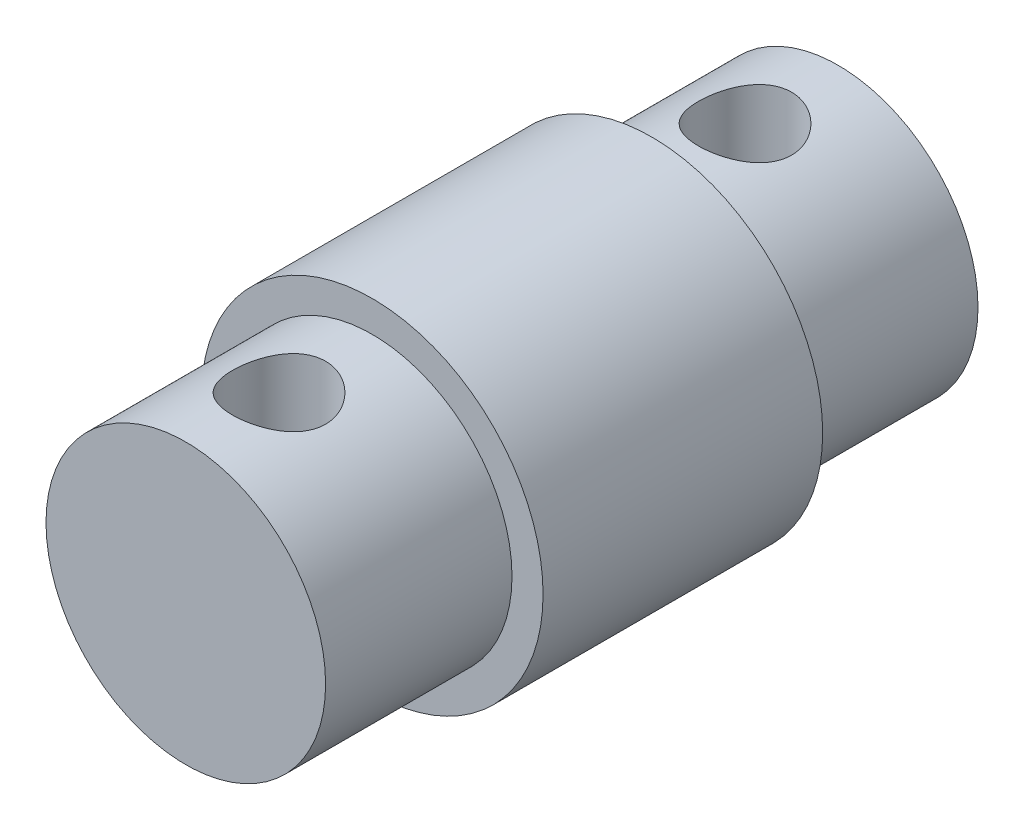
ISO-10303-21;
HEADER;
FILE_DESCRIPTION(('STEP AP214'),'2;1');
FILE_NAME('part.step','',(''),(''),'','','');
FILE_SCHEMA(('AUTOMOTIVE_DESIGN { 1 0 10303 214 1 1 1 1 }'));
ENDSEC;
DATA;
#1=APPLICATION_CONTEXT('core data for automotive mechanical design processes');
#2=APPLICATION_PROTOCOL_DEFINITION('international standard','automotive_design',2000,#1);
#3=PRODUCT_CONTEXT('',#1,'mechanical');
#4=PRODUCT('Part','Part','',(#3));
#5=PRODUCT_RELATED_PRODUCT_CATEGORY('part','',(#4));
#6=PRODUCT_DEFINITION_FORMATION('','',#4);
#7=PRODUCT_DEFINITION_CONTEXT('part definition',#1,'design');
#8=PRODUCT_DEFINITION('design','',#6,#7);
#9=PRODUCT_DEFINITION_SHAPE('','',#8);
#10=(LENGTH_UNIT() NAMED_UNIT(*) SI_UNIT(.MILLI.,.METRE.));
#11=(NAMED_UNIT(*) PLANE_ANGLE_UNIT() SI_UNIT($,.RADIAN.));
#12=(NAMED_UNIT(*) SI_UNIT($,.STERADIAN.) SOLID_ANGLE_UNIT());
#13=UNCERTAINTY_MEASURE_WITH_UNIT(LENGTH_MEASURE(1.E-05),#10,'distance_accuracy_value','');
#14=(GEOMETRIC_REPRESENTATION_CONTEXT(3) GLOBAL_UNCERTAINTY_ASSIGNED_CONTEXT((#13)) GLOBAL_UNIT_ASSIGNED_CONTEXT((#10,
#11,#12)) REPRESENTATION_CONTEXT('',''));
#15=CARTESIAN_POINT('',(0.,0.,0.));
#16=DIRECTION('',(0.,0.,1.));
#17=DIRECTION('',(1.,0.,0.));
#18=AXIS2_PLACEMENT_3D('',#15,#16,#17);
#19=CARTESIAN_POINT('',(0.,0.,9.));
#20=DIRECTION('',(0.,0.,-1.));
#21=DIRECTION('',(-1.,0.,0.));
#22=AXIS2_PLACEMENT_3D('',#19,#20,#21);
#23=CYLINDRICAL_SURFACE('',#22,5.5);
#24=CARTESIAN_POINT('',(0.,0.,9.));
#25=DIRECTION('',(0.,0.,1.));
#26=DIRECTION('',(1.,0.,0.));
#27=AXIS2_PLACEMENT_3D('',#24,#25,#26);
#28=CIRCLE('',#27,5.5);
#29=CARTESIAN_POINT('',(5.5,0.,9.));
#30=VERTEX_POINT('',#29);
#31=EDGE_CURVE('E62',#30,#30,#28,.T.);
#32=ORIENTED_EDGE('',*,*,#31,.F.);
#33=EDGE_LOOP('',(#32));
#34=FACE_BOUND('',#33,.T.);
#35=CARTESIAN_POINT('',(0.,0.,0.));
#36=DIRECTION('',(0.,0.,1.));
#37=DIRECTION('',(1.,0.,0.));
#38=AXIS2_PLACEMENT_3D('',#35,#36,#37);
#39=CIRCLE('',#38,5.5);
#40=CARTESIAN_POINT('',(5.5,0.,0.));
#41=VERTEX_POINT('',#40);
#42=EDGE_CURVE('E70',#41,#41,#39,.T.);
#43=ORIENTED_EDGE('',*,*,#42,.T.);
#44=EDGE_LOOP('',(#43));
#45=FACE_BOUND('',#44,.T.);
#46=ADVANCED_FACE('F43',(#34,#45),#23,.T.);
#47=CARTESIAN_POINT('',(0.,0.,9.));
#48=DIRECTION('',(0.,0.,1.));
#49=DIRECTION('',(1.,0.,0.));
#50=AXIS2_PLACEMENT_3D('',#47,#48,#49);
#51=PLANE('',#50);
#52=CARTESIAN_POINT('',(0.,0.,9.));
#53=DIRECTION('',(0.,0.,1.));
#54=DIRECTION('',(1.,0.,0.));
#55=AXIS2_PLACEMENT_3D('',#52,#53,#54);
#56=CIRCLE('',#55,4.5);
#57=CARTESIAN_POINT('',(4.5,0.,9.));
#58=VERTEX_POINT('',#57);
#59=EDGE_CURVE('E56',#58,#58,#56,.T.);
#60=ORIENTED_EDGE('',*,*,#59,.F.);
#61=EDGE_LOOP('',(#60));
#62=FACE_BOUND('',#61,.T.);
#63=ORIENTED_EDGE('',*,*,#31,.T.);
#64=EDGE_LOOP('',(#63));
#65=FACE_BOUND('',#64,.T.);
#66=ADVANCED_FACE('F119',(#62,#65),#51,.T.);
#67=CARTESIAN_POINT('',(0.,0.,0.));
#68=DIRECTION('',(0.,0.,1.));
#69=DIRECTION('',(1.,0.,0.));
#70=AXIS2_PLACEMENT_3D('',#67,#68,#69);
#71=PLANE('',#70);
#72=CARTESIAN_POINT('',(0.,0.,0.));
#73=DIRECTION('',(0.,0.,-1.));
#74=DIRECTION('',(-1.,0.,0.));
#75=AXIS2_PLACEMENT_3D('',#72,#73,#74);
#76=CIRCLE('',#75,4.5);
#77=CARTESIAN_POINT('',(-4.5,0.,0.));
#78=VERTEX_POINT('',#77);
#79=EDGE_CURVE('E10',#78,#78,#76,.T.);
#80=ORIENTED_EDGE('',*,*,#79,.F.);
#81=EDGE_LOOP('',(#80));
#82=FACE_BOUND('',#81,.T.);
#83=ORIENTED_EDGE('',*,*,#42,.F.);
#84=EDGE_LOOP('',(#83));
#85=FACE_BOUND('',#84,.T.);
#86=ADVANCED_FACE('F117',(#82,#85),#71,.F.);
#87=CARTESIAN_POINT('',(0.,0.,15.));
#88=DIRECTION('',(0.,0.,-1.));
#89=DIRECTION('',(-1.,0.,0.));
#90=AXIS2_PLACEMENT_3D('',#87,#88,#89);
#91=CYLINDRICAL_SURFACE('',#90,4.5);
#92=CARTESIAN_POINT('',(0.,-4.5,13.5));
#93=CARTESIAN_POINT('',(0.0818450443300849,-4.50000022951416,13.5000003805975));
#94=CARTESIAN_POINT('',(0.163687791807825,-4.49774654261317,13.4932796008092));
#95=CARTESIAN_POINT('',(0.324962641309459,-4.48897815304921,13.4666563367742));
#96=CARTESIAN_POINT('',(0.404394492178227,-4.48246300803229,13.4467524840766));
#97=CARTESIAN_POINT('',(0.558499184252665,-4.46587961859664,13.3945211349239));
#98=CARTESIAN_POINT('',(0.633179738829052,-4.4558173159628,13.3622144063111));
#99=CARTESIAN_POINT('',(0.776062405207988,-4.43316668576013,13.2861882407425));
#100=CARTESIAN_POINT('',(0.844263235438059,-4.42057786001667,13.2424665524961));
#101=CARTESIAN_POINT('',(0.9746125125334,-4.39371141664507,13.1432612927119));
#102=CARTESIAN_POINT('',(1.03650555044746,-4.37939334695677,13.0874531486093));
#103=CARTESIAN_POINT('',(1.15024903905313,-4.35090472174682,12.9663492679401));
#104=CARTESIAN_POINT('',(1.20209727823419,-4.33673419935823,12.9010514476072));
#105=CARTESIAN_POINT('',(1.29573741334179,-4.30969998715911,12.7605223272053));
#106=CARTESIAN_POINT('',(1.33719728733155,-4.29688558913532,12.6850593904018));
#107=CARTESIAN_POINT('',(1.40672831081658,-4.27462958127902,12.5277358583122));
#108=CARTESIAN_POINT('',(1.43480354608015,-4.26518694241118,12.4458772242559));
#109=CARTESIAN_POINT('',(1.47581019226375,-4.25116954904066,12.2809901677549));
#110=CARTESIAN_POINT('',(1.48922017240765,-4.24644143654417,12.1980941872664));
#111=CARTESIAN_POINT('',(1.50201168500172,-4.24193484944261,12.0311043687662));
#112=CARTESIAN_POINT('',(1.50139755240708,-4.24215484534095,11.9470109089362));
#113=CARTESIAN_POINT('',(1.48652985555513,-4.2473852251227,11.784095054334));
#114=CARTESIAN_POINT('',(1.47290086975049,-4.25217623801299,11.7052073956215));
#115=CARTESIAN_POINT('',(1.43340924427413,-4.26564986586826,11.5509098705897));
#116=CARTESIAN_POINT('',(1.40754513988781,-4.27433294676161,11.4755004218474));
#117=CARTESIAN_POINT('',(1.34390858709032,-4.29476866696873,11.3288808756128));
#118=CARTESIAN_POINT('',(1.30595107306089,-4.30656848689676,11.2577579617957));
#119=CARTESIAN_POINT('',(1.21933365945471,-4.3318883786359,11.1226936375804));
#120=CARTESIAN_POINT('',(1.17067066854601,-4.34540894685695,11.0587543095999));
#121=CARTESIAN_POINT('',(1.06102399902336,-4.37350993751611,10.9363626027588));
#122=CARTESIAN_POINT('',(0.999529725114467,-4.38810884032264,10.8783709582364));
#123=CARTESIAN_POINT('',(0.867509354955096,-4.41610407580555,10.7734031000049));
#124=CARTESIAN_POINT('',(0.796982393491222,-4.42950029307101,10.7264279427533));
#125=CARTESIAN_POINT('',(0.647921419569403,-4.4537566190669,10.6444555496474));
#126=CARTESIAN_POINT('',(0.569314914624506,-4.46459025012059,10.6095817629889));
#127=CARTESIAN_POINT('',(0.406903625046762,-4.48230850716652,10.5536952390664));
#128=CARTESIAN_POINT('',(0.323100657232431,-4.48919450482319,10.5326776868648));
#129=CARTESIAN_POINT('',(0.156575744293956,-4.49801440607161,10.5059165009665));
#130=CARTESIAN_POINT('',(0.0739643997972695,-4.50015002750592,10.4995502862409));
#131=CARTESIAN_POINT('',(-0.0911626049403559,-4.49983354042241,10.5004990103977));
#132=CARTESIAN_POINT('',(-0.173678278979476,-4.49738220629043,10.5078116399698));
#133=CARTESIAN_POINT('',(-0.333779799456384,-4.48830037075656,10.5354178616039));
#134=CARTESIAN_POINT('',(-0.411439210252266,-4.48179298066788,10.5553293090742));
#135=CARTESIAN_POINT('',(-0.562283937869361,-4.46537770245105,10.6070901667001));
#136=CARTESIAN_POINT('',(-0.63546868276291,-4.45546938070013,10.6389410992017));
#137=CARTESIAN_POINT('',(-0.77743244458991,-4.43293396930935,10.7146056477612));
#138=CARTESIAN_POINT('',(-0.84604493882572,-4.42024222133679,10.7587118899248));
#139=CARTESIAN_POINT('',(-0.975097245203379,-4.39357880874394,10.8572912250202));
#140=CARTESIAN_POINT('',(-1.03553455169336,-4.37960675390741,10.9117674840476));
#141=CARTESIAN_POINT('',(-1.14937876170945,-4.35115271970667,11.0324681265099));
#142=CARTESIAN_POINT('',(-1.20234145386866,-4.33667641631142,11.0991138403903));
#143=CARTESIAN_POINT('',(-1.29638628348536,-4.30949959942063,11.2406573517163));
#144=CARTESIAN_POINT('',(-1.33746832189652,-4.29679910073003,11.3155552179511));
#145=CARTESIAN_POINT('',(-1.40639539562454,-4.27473587687075,11.4715095229348));
#146=CARTESIAN_POINT('',(-1.43426719824753,-4.26536641189468,11.5525531187531));
#147=CARTESIAN_POINT('',(-1.47584200013903,-4.25116248459674,11.7185679750662));
#148=CARTESIAN_POINT('',(-1.48955138243091,-4.24632597935459,11.8035374481065));
#149=CARTESIAN_POINT('',(-1.50191442371601,-4.24196788311266,11.9702956440614));
#150=CARTESIAN_POINT('',(-1.5013053859626,-4.24218600386123,12.0520235104302));
#151=CARTESIAN_POINT('',(-1.48686344017304,-4.24726904735801,12.2141476123831));
#152=CARTESIAN_POINT('',(-1.47303131918788,-4.25213369354042,12.2945439269326));
#153=CARTESIAN_POINT('',(-1.43305771969402,-4.26576786457337,12.4502034945037));
#154=CARTESIAN_POINT('',(-1.40715501902327,-4.27446147033716,12.5255352375067));
#155=CARTESIAN_POINT('',(-1.34396904863962,-4.29474598227703,12.6708411104074));
#156=CARTESIAN_POINT('',(-1.30668325283071,-4.3063375314509,12.740814046782));
#157=CARTESIAN_POINT('',(-1.21989103887515,-4.33174243839069,12.8767255048844));
#158=CARTESIAN_POINT('',(-1.16992236414687,-4.34563067463205,12.9423547528476));
#159=CARTESIAN_POINT('',(-1.05996432470347,-4.37375034424879,13.0645347200763));
#160=CARTESIAN_POINT('',(-0.999972126677223,-4.38798187368558,13.1210828635321));
#161=CARTESIAN_POINT('',(-0.868862335381033,-4.41585045788316,13.2257166184338));
#162=CARTESIAN_POINT('',(-0.797402270249594,-4.42944272701885,13.2733865216265));
#163=CARTESIAN_POINT('',(-0.647036036109938,-4.45388986758918,13.355985643276));
#164=CARTESIAN_POINT('',(-0.568131777198524,-4.46474543861895,13.3909181188831));
#165=CARTESIAN_POINT('',(-0.408740470801464,-4.48208272602813,13.445582448733));
#166=CARTESIAN_POINT('',(-0.328481636514613,-4.48873818633784,13.4659236993951));
#167=CARTESIAN_POINT('',(-0.165480624015371,-4.49769610596333,13.4931304210157));
#168=CARTESIAN_POINT('',(-0.0827391383531197,-4.49999976797857,13.4999996152448));
#169=CARTESIAN_POINT('',(0.,-4.5,13.5));
#170=B_SPLINE_CURVE_WITH_KNOTS('',3,(#92,#93,#94,#95,#96,#97,#98,#99,#100,#101,#102,#103,#104,
#105,#106,#107,#108,#109,#110,#111,#112,#113,#114,#115,#116,#117,#118,#119,#120,#121,#122,#123,
#124,#125,#126,#127,#128,#129,#130,#131,#132,#133,#134,#135,#136,#137,#138,#139,#140,#141,#142,
#143,#144,#145,#146,#147,#148,#149,#150,#151,#152,#153,#154,#155,#156,#157,#158,#159,#160,#161,
#162,#163,#164,#165,#166,#167,#168,#169),.UNSPECIFIED.,.T.,.F.,(4,2,2,2,2,2,2,2,2,2,2,2,2,2,2,2,
2,2,2,2,2,2,2,2,2,2,2,2,2,2,2,2,2,2,2,2,2,2,4),(0.,0.245230659039017,0.490486777901282,
0.735334009305411,0.980229566698651,1.23277026424134,1.48536649931296,1.74522577235206,
2.0050056703925,2.2560288861276,2.50697450981228,2.74645239826921,2.98595896283223,
3.22932256732696,3.47275653837311,3.72889958717051,3.98506718949928,4.24377608475536,
4.50239503315813,4.74980374762755,4.99717069746265,5.23737236967321,5.47760467926156,
5.72415599765605,5.97078271232837,6.22861534321128,6.48645012352495,6.74376020740156,
7.00095427058761,7.24493499096387,7.48890119027063,7.72823380620627,7.96761957263967,
8.21745100037707,8.46735316685669,8.72699491252651,8.98657021728685,9.23454837560721,
9.4824579905721),.UNSPECIFIED.);
#171=CARTESIAN_POINT('',(0.,-4.5,13.5));
#172=VERTEX_POINT('',#171);
#173=EDGE_CURVE('E46',#172,#172,#170,.T.);
#174=ORIENTED_EDGE('',*,*,#173,.T.);
#175=EDGE_LOOP('',(#174));
#176=FACE_BOUND('',#175,.T.);
#177=CARTESIAN_POINT('',(0.,4.5,13.5));
#178=CARTESIAN_POINT('',(-0.0818450443300849,4.50000022951416,13.5000003805975));
#179=CARTESIAN_POINT('',(-0.163687791807825,4.49774654261317,13.4932796008092));
#180=CARTESIAN_POINT('',(-0.324962641309459,4.48897815304921,13.4666563367742));
#181=CARTESIAN_POINT('',(-0.404394492178227,4.48246300803229,13.4467524840766));
#182=CARTESIAN_POINT('',(-0.558499184252665,4.46587961859664,13.3945211349239));
#183=CARTESIAN_POINT('',(-0.633179738829052,4.4558173159628,13.3622144063111));
#184=CARTESIAN_POINT('',(-0.776062405207988,4.43316668576013,13.2861882407425));
#185=CARTESIAN_POINT('',(-0.844263235438059,4.42057786001667,13.2424665524961));
#186=CARTESIAN_POINT('',(-0.9746125125334,4.39371141664507,13.1432612927119));
#187=CARTESIAN_POINT('',(-1.03650555044746,4.37939334695677,13.0874531486093));
#188=CARTESIAN_POINT('',(-1.15024903905313,4.35090472174682,12.9663492679401));
#189=CARTESIAN_POINT('',(-1.20209727823419,4.33673419935823,12.9010514476072));
#190=CARTESIAN_POINT('',(-1.29573741334179,4.30969998715911,12.7605223272053));
#191=CARTESIAN_POINT('',(-1.33719728733155,4.29688558913532,12.6850593904018));
#192=CARTESIAN_POINT('',(-1.40672831081658,4.27462958127902,12.5277358583122));
#193=CARTESIAN_POINT('',(-1.43480354608015,4.26518694241118,12.4458772242559));
#194=CARTESIAN_POINT('',(-1.47581019226375,4.25116954904066,12.2809901677549));
#195=CARTESIAN_POINT('',(-1.48922017240765,4.24644143654417,12.1980941872664));
#196=CARTESIAN_POINT('',(-1.50201168500172,4.24193484944261,12.0311043687662));
#197=CARTESIAN_POINT('',(-1.50139755240708,4.24215484534095,11.9470109089362));
#198=CARTESIAN_POINT('',(-1.48652985555513,4.2473852251227,11.784095054334));
#199=CARTESIAN_POINT('',(-1.47290086975049,4.25217623801299,11.7052073956215));
#200=CARTESIAN_POINT('',(-1.43340924427413,4.26564986586826,11.5509098705897));
#201=CARTESIAN_POINT('',(-1.40754513988781,4.27433294676161,11.4755004218474));
#202=CARTESIAN_POINT('',(-1.34390858709032,4.29476866696873,11.3288808756128));
#203=CARTESIAN_POINT('',(-1.30595107306089,4.30656848689676,11.2577579617957));
#204=CARTESIAN_POINT('',(-1.21933365945471,4.3318883786359,11.1226936375804));
#205=CARTESIAN_POINT('',(-1.17067066854601,4.34540894685695,11.0587543095999));
#206=CARTESIAN_POINT('',(-1.06102399902336,4.37350993751611,10.9363626027588));
#207=CARTESIAN_POINT('',(-0.999529725114467,4.38810884032264,10.8783709582364));
#208=CARTESIAN_POINT('',(-0.867509354955096,4.41610407580555,10.7734031000049));
#209=CARTESIAN_POINT('',(-0.796982393491222,4.42950029307101,10.7264279427533));
#210=CARTESIAN_POINT('',(-0.647921419569403,4.4537566190669,10.6444555496474));
#211=CARTESIAN_POINT('',(-0.569314914624506,4.46459025012059,10.6095817629889));
#212=CARTESIAN_POINT('',(-0.406903625046762,4.48230850716652,10.5536952390664));
#213=CARTESIAN_POINT('',(-0.323100657232431,4.48919450482319,10.5326776868648));
#214=CARTESIAN_POINT('',(-0.156575744293956,4.49801440607161,10.5059165009665));
#215=CARTESIAN_POINT('',(-0.0739643997972695,4.50015002750592,10.4995502862409));
#216=CARTESIAN_POINT('',(0.0911626049403559,4.49983354042241,10.5004990103977));
#217=CARTESIAN_POINT('',(0.173678278979476,4.49738220629043,10.5078116399698));
#218=CARTESIAN_POINT('',(0.333779799456384,4.48830037075656,10.5354178616039));
#219=CARTESIAN_POINT('',(0.411439210252266,4.48179298066788,10.5553293090742));
#220=CARTESIAN_POINT('',(0.562283937869361,4.46537770245105,10.6070901667001));
#221=CARTESIAN_POINT('',(0.63546868276291,4.45546938070013,10.6389410992017));
#222=CARTESIAN_POINT('',(0.77743244458991,4.43293396930935,10.7146056477612));
#223=CARTESIAN_POINT('',(0.84604493882572,4.42024222133679,10.7587118899248));
#224=CARTESIAN_POINT('',(0.975097245203379,4.39357880874394,10.8572912250202));
#225=CARTESIAN_POINT('',(1.03553455169336,4.37960675390741,10.9117674840476));
#226=CARTESIAN_POINT('',(1.14937876170945,4.35115271970667,11.0324681265099));
#227=CARTESIAN_POINT('',(1.20234145386866,4.33667641631142,11.0991138403903));
#228=CARTESIAN_POINT('',(1.29638628348536,4.30949959942063,11.2406573517163));
#229=CARTESIAN_POINT('',(1.33746832189652,4.29679910073003,11.3155552179511));
#230=CARTESIAN_POINT('',(1.40639539562454,4.27473587687075,11.4715095229348));
#231=CARTESIAN_POINT('',(1.43426719824753,4.26536641189468,11.5525531187531));
#232=CARTESIAN_POINT('',(1.47584200013903,4.25116248459674,11.7185679750662));
#233=CARTESIAN_POINT('',(1.48955138243091,4.24632597935459,11.8035374481065));
#234=CARTESIAN_POINT('',(1.50191442371601,4.24196788311266,11.9702956440614));
#235=CARTESIAN_POINT('',(1.5013053859626,4.24218600386123,12.0520235104302));
#236=CARTESIAN_POINT('',(1.48686344017304,4.24726904735801,12.2141476123831));
#237=CARTESIAN_POINT('',(1.47303131918788,4.25213369354042,12.2945439269326));
#238=CARTESIAN_POINT('',(1.43305771969402,4.26576786457337,12.4502034945037));
#239=CARTESIAN_POINT('',(1.40715501902327,4.27446147033716,12.5255352375067));
#240=CARTESIAN_POINT('',(1.34396904863962,4.29474598227703,12.6708411104074));
#241=CARTESIAN_POINT('',(1.30668325283071,4.3063375314509,12.740814046782));
#242=CARTESIAN_POINT('',(1.21989103887515,4.33174243839069,12.8767255048844));
#243=CARTESIAN_POINT('',(1.16992236414687,4.34563067463205,12.9423547528476));
#244=CARTESIAN_POINT('',(1.05996432470347,4.37375034424879,13.0645347200763));
#245=CARTESIAN_POINT('',(0.999972126677223,4.38798187368558,13.1210828635321));
#246=CARTESIAN_POINT('',(0.868862335381033,4.41585045788316,13.2257166184338));
#247=CARTESIAN_POINT('',(0.797402270249594,4.42944272701885,13.2733865216265));
#248=CARTESIAN_POINT('',(0.647036036109938,4.45388986758918,13.355985643276));
#249=CARTESIAN_POINT('',(0.568131777198524,4.46474543861895,13.3909181188831));
#250=CARTESIAN_POINT('',(0.408740470801464,4.48208272602813,13.445582448733));
#251=CARTESIAN_POINT('',(0.328481636514613,4.48873818633784,13.4659236993951));
#252=CARTESIAN_POINT('',(0.165480624015371,4.49769610596333,13.4931304210157));
#253=CARTESIAN_POINT('',(0.0827391383531197,4.49999976797857,13.4999996152448));
#254=CARTESIAN_POINT('',(0.,4.5,13.5));
#255=B_SPLINE_CURVE_WITH_KNOTS('',3,(#177,#178,#179,#180,#181,#182,#183,#184,#185,#186,#187,
#188,#189,#190,#191,#192,#193,#194,#195,#196,#197,#198,#199,#200,#201,#202,#203,#204,#205,#206,
#207,#208,#209,#210,#211,#212,#213,#214,#215,#216,#217,#218,#219,#220,#221,#222,#223,#224,#225,
#226,#227,#228,#229,#230,#231,#232,#233,#234,#235,#236,#237,#238,#239,#240,#241,#242,#243,#244,
#245,#246,#247,#248,#249,#250,#251,#252,#253,#254),.UNSPECIFIED.,.T.,.F.,(4,2,2,2,2,2,2,2,2,2,2,
2,2,2,2,2,2,2,2,2,2,2,2,2,2,2,2,2,2,2,2,2,2,2,2,2,2,2,4),(0.,0.245230659039017,
0.490486777901282,0.735334009305411,0.980229566698651,1.23277026424134,1.48536649931296,
1.74522577235206,2.0050056703925,2.2560288861276,2.50697450981228,2.74645239826921,
2.98595896283223,3.22932256732696,3.47275653837311,3.72889958717051,3.98506718949928,
4.24377608475536,4.50239503315813,4.74980374762755,4.99717069746265,5.23737236967321,
5.47760467926156,5.72415599765605,5.97078271232837,6.22861534321128,6.48645012352495,
6.74376020740156,7.00095427058761,7.24493499096387,7.48890119027063,7.72823380620627,
7.96761957263967,8.21745100037707,8.46735316685669,8.72699491252651,8.98657021728685,
9.23454837560721,9.4824579905721),.UNSPECIFIED.);
#256=CARTESIAN_POINT('',(0.,4.5,13.5));
#257=VERTEX_POINT('',#256);
#258=EDGE_CURVE('E106',#257,#257,#255,.T.);
#259=ORIENTED_EDGE('',*,*,#258,.T.);
#260=EDGE_LOOP('',(#259));
#261=FACE_BOUND('',#260,.T.);
#262=CARTESIAN_POINT('',(0.,0.,15.));
#263=DIRECTION('',(0.,0.,1.));
#264=DIRECTION('',(1.,0.,0.));
#265=AXIS2_PLACEMENT_3D('',#262,#263,#264);
#266=CIRCLE('',#265,4.5);
#267=CARTESIAN_POINT('',(4.5,0.,15.));
#268=VERTEX_POINT('',#267);
#269=EDGE_CURVE('E67',#268,#268,#266,.T.);
#270=ORIENTED_EDGE('',*,*,#269,.F.);
#271=EDGE_LOOP('',(#270));
#272=FACE_BOUND('',#271,.T.);
#273=ORIENTED_EDGE('',*,*,#59,.T.);
#274=EDGE_LOOP('',(#273));
#275=FACE_BOUND('',#274,.T.);
#276=ADVANCED_FACE('F112',(#176,#261,#272,#275),#91,.T.);
#277=CARTESIAN_POINT('',(0.,0.,15.));
#278=DIRECTION('',(0.,0.,1.));
#279=DIRECTION('',(1.,0.,0.));
#280=AXIS2_PLACEMENT_3D('',#277,#278,#279);
#281=PLANE('',#280);
#282=ORIENTED_EDGE('',*,*,#269,.T.);
#283=EDGE_LOOP('',(#282));
#284=FACE_BOUND('',#283,.T.);
#285=ADVANCED_FACE('F116',(#284),#281,.T.);
#286=CARTESIAN_POINT('',(0.,0.,-6.));
#287=DIRECTION('',(0.,0.,1.));
#288=DIRECTION('',(1.,0.,0.));
#289=AXIS2_PLACEMENT_3D('',#286,#287,#288);
#290=CYLINDRICAL_SURFACE('',#289,4.5);
#291=CARTESIAN_POINT('',(0.,-4.5,-1.5));
#292=CARTESIAN_POINT('',(0.0818450443300848,-4.50000022951416,-1.49999961940254));
#293=CARTESIAN_POINT('',(0.163687791807825,-4.49774654261317,-1.50672039919083));
#294=CARTESIAN_POINT('',(0.324962641309458,-4.48897815304921,-1.53334366322583));
#295=CARTESIAN_POINT('',(0.404394492178227,-4.48246300803229,-1.55324751592338));
#296=CARTESIAN_POINT('',(0.558499184252664,-4.46587961859664,-1.60547886507607));
#297=CARTESIAN_POINT('',(0.633179738829051,-4.4558173159628,-1.63778559368891));
#298=CARTESIAN_POINT('',(0.776062405207987,-4.43316668576013,-1.71381175925752));
#299=CARTESIAN_POINT('',(0.844263235438059,-4.42057786001667,-1.7575334475039));
#300=CARTESIAN_POINT('',(0.9746125125334,-4.39371141664507,-1.85673870728813));
#301=CARTESIAN_POINT('',(1.03650555044746,-4.37939334695677,-1.91254685139074));
#302=CARTESIAN_POINT('',(1.15024903905313,-4.35090472174682,-2.03365073205985));
#303=CARTESIAN_POINT('',(1.20209727823419,-4.33673419935824,-2.09894855239277));
#304=CARTESIAN_POINT('',(1.29573741334179,-4.30969998715911,-2.23947767279469));
#305=CARTESIAN_POINT('',(1.33719728733155,-4.29688558913532,-2.31494060959818));
#306=CARTESIAN_POINT('',(1.40672831081658,-4.27462958127902,-2.47226414168782));
#307=CARTESIAN_POINT('',(1.43480354608015,-4.26518694241118,-2.55412277574412));
#308=CARTESIAN_POINT('',(1.47581019226374,-4.25116954904066,-2.71900983224507));
#309=CARTESIAN_POINT('',(1.48922017240765,-4.24644143654417,-2.8019058127336));
#310=CARTESIAN_POINT('',(1.50201168500172,-4.24193484944261,-2.96889563123382));
#311=CARTESIAN_POINT('',(1.50139755240708,-4.24215484534095,-3.05298909106379));
#312=CARTESIAN_POINT('',(1.48652985555513,-4.2473852251227,-3.21590494566603));
#313=CARTESIAN_POINT('',(1.47290086975049,-4.25217623801299,-3.29479260437853));
#314=CARTESIAN_POINT('',(1.43340924427413,-4.26564986586826,-3.44909012941025));
#315=CARTESIAN_POINT('',(1.40754513988781,-4.27433294676161,-3.5244995781526));
#316=CARTESIAN_POINT('',(1.34390858709032,-4.29476866696873,-3.67111912438722));
#317=CARTESIAN_POINT('',(1.30595107306089,-4.30656848689676,-3.74224203820429));
#318=CARTESIAN_POINT('',(1.21933365945471,-4.3318883786359,-3.87730636241959));
#319=CARTESIAN_POINT('',(1.17067066854601,-4.34540894685695,-3.94124569040007));
#320=CARTESIAN_POINT('',(1.06102399902336,-4.37350993751611,-4.06363739724116));
#321=CARTESIAN_POINT('',(0.999529725114467,-4.38810884032264,-4.1216290417636));
#322=CARTESIAN_POINT('',(0.867509354955096,-4.41610407580555,-4.2265968999951));
#323=CARTESIAN_POINT('',(0.796982393491222,-4.42950029307101,-4.27357205724674));
#324=CARTESIAN_POINT('',(0.647921419569402,-4.4537566190669,-4.3555444503526));
#325=CARTESIAN_POINT('',(0.569314914624505,-4.46459025012059,-4.3904182370111));
#326=CARTESIAN_POINT('',(0.406903625046761,-4.48230850716652,-4.44630476093357));
#327=CARTESIAN_POINT('',(0.323100657232431,-4.48919450482319,-4.46732231313516));
#328=CARTESIAN_POINT('',(0.156575744293956,-4.49801440607161,-4.49408349903354));
#329=CARTESIAN_POINT('',(0.0739643997972698,-4.50015002750592,-4.50044971375913));
#330=CARTESIAN_POINT('',(-0.0911626049403558,-4.49983354042241,-4.4995009896023));
#331=CARTESIAN_POINT('',(-0.173678278979476,-4.49738220629043,-4.49218836003019));
#332=CARTESIAN_POINT('',(-0.333779799456383,-4.48830037075656,-4.46458213839606));
#333=CARTESIAN_POINT('',(-0.411439210252265,-4.48179298066788,-4.44467069092576));
#334=CARTESIAN_POINT('',(-0.56228393786936,-4.46537770245105,-4.39290983329991));
#335=CARTESIAN_POINT('',(-0.63546868276291,-4.45546938070013,-4.36105890079832));
#336=CARTESIAN_POINT('',(-0.77743244458991,-4.43293396930935,-4.28539435223882));
#337=CARTESIAN_POINT('',(-0.846044938825721,-4.42024222133679,-4.24128811007524));
#338=CARTESIAN_POINT('',(-0.97509724520338,-4.39357880874394,-4.14270877497977));
#339=CARTESIAN_POINT('',(-1.03553455169337,-4.37960675390741,-4.08823251595235));
#340=CARTESIAN_POINT('',(-1.14937876170945,-4.35115271970667,-3.96753187349012));
#341=CARTESIAN_POINT('',(-1.20234145386866,-4.33667641631142,-3.90088615960971));
#342=CARTESIAN_POINT('',(-1.29638628348536,-4.30949959942063,-3.75934264828367));
#343=CARTESIAN_POINT('',(-1.33746832189652,-4.29679910073003,-3.68444478204889));
#344=CARTESIAN_POINT('',(-1.40639539562454,-4.27473587687075,-3.52849047706516));
#345=CARTESIAN_POINT('',(-1.43426719824753,-4.26536641189468,-3.44744688124685));
#346=CARTESIAN_POINT('',(-1.47584200013903,-4.25116248459674,-3.2814320249338));
#347=CARTESIAN_POINT('',(-1.48955138243091,-4.24632597935459,-3.19646255189348));
#348=CARTESIAN_POINT('',(-1.50191442371601,-4.24196788311266,-3.02970435593862));
#349=CARTESIAN_POINT('',(-1.5013053859626,-4.24218600386123,-2.94797648956976));
#350=CARTESIAN_POINT('',(-1.48686344017304,-4.24726904735801,-2.78585238761691));
#351=CARTESIAN_POINT('',(-1.47303131918788,-4.25213369354042,-2.70545607306737));
#352=CARTESIAN_POINT('',(-1.43305771969402,-4.26576786457337,-2.54979650549629));
#353=CARTESIAN_POINT('',(-1.40715501902327,-4.27446147033716,-2.47446476249325));
#354=CARTESIAN_POINT('',(-1.34396904863962,-4.29474598227703,-2.3291588895926));
#355=CARTESIAN_POINT('',(-1.30668325283071,-4.3063375314509,-2.25918595321799));
#356=CARTESIAN_POINT('',(-1.21989103887514,-4.33174243839069,-2.12327449511563));
#357=CARTESIAN_POINT('',(-1.16992236414687,-4.34563067463206,-2.05764524715242));
#358=CARTESIAN_POINT('',(-1.05996432470347,-4.37375034424879,-1.9354652799237));
#359=CARTESIAN_POINT('',(-0.999972126677222,-4.38798187368559,-1.87891713646789));
#360=CARTESIAN_POINT('',(-0.868862335381032,-4.41585045788316,-1.77428338156623));
#361=CARTESIAN_POINT('',(-0.797402270249593,-4.42944272701885,-1.7266134783735));
#362=CARTESIAN_POINT('',(-0.647036036109937,-4.45388986758918,-1.64401435672403));
#363=CARTESIAN_POINT('',(-0.568131777198522,-4.46474543861895,-1.60908188111694));
#364=CARTESIAN_POINT('',(-0.408740470801464,-4.48208272602813,-1.55441755126699));
#365=CARTESIAN_POINT('',(-0.328481636514613,-4.48873818633784,-1.53407630060494));
#366=CARTESIAN_POINT('',(-0.165480624015371,-4.49769610596333,-1.50686957898431));
#367=CARTESIAN_POINT('',(-0.0827391383531198,-4.49999976797857,-1.50000038475519));
#368=CARTESIAN_POINT('',(0.,-4.5,-1.5));
#369=B_SPLINE_CURVE_WITH_KNOTS('',3,(#291,#292,#293,#294,#295,#296,#297,#298,#299,#300,#301,
#302,#303,#304,#305,#306,#307,#308,#309,#310,#311,#312,#313,#314,#315,#316,#317,#318,#319,#320,
#321,#322,#323,#324,#325,#326,#327,#328,#329,#330,#331,#332,#333,#334,#335,#336,#337,#338,#339,
#340,#341,#342,#343,#344,#345,#346,#347,#348,#349,#350,#351,#352,#353,#354,#355,#356,#357,#358,
#359,#360,#361,#362,#363,#364,#365,#366,#367,#368),.UNSPECIFIED.,.T.,.F.,(4,2,2,2,2,2,2,2,2,2,2,
2,2,2,2,2,2,2,2,2,2,2,2,2,2,2,2,2,2,2,2,2,2,2,2,2,2,2,4),(0.,0.245230659039016,
0.490486777901281,0.735334009305411,0.98022956669865,1.23277026424134,1.48536649931295,
1.74522577235206,2.0050056703925,2.2560288861276,2.50697450981228,2.7464523982692,
2.98595896283223,3.22932256732696,3.47275653837311,3.7288995871705,3.98506718949927,
4.24377608475536,4.50239503315812,4.74980374762754,4.99717069746265,5.2373723696732,
5.47760467926156,5.72415599765605,5.97078271232837,6.22861534321128,6.48645012352495,
6.74376020740156,7.0009542705876,7.24493499096388,7.48890119027063,7.72823380620626,
7.96761957263967,8.21745100037707,8.46735316685668,8.72699491252651,8.98657021728685,
9.23454837560721,9.4824579905721),.UNSPECIFIED.);
#370=CARTESIAN_POINT('',(0.,-4.5,-1.5));
#371=VERTEX_POINT('',#370);
#372=EDGE_CURVE('E87',#371,#371,#369,.T.);
#373=ORIENTED_EDGE('',*,*,#372,.T.);
#374=EDGE_LOOP('',(#373));
#375=FACE_BOUND('',#374,.T.);
#376=CARTESIAN_POINT('',(0.,4.5,-1.5));
#377=CARTESIAN_POINT('',(-0.0818450443300848,4.50000022951416,-1.49999961940254));
#378=CARTESIAN_POINT('',(-0.163687791807825,4.49774654261317,-1.50672039919083));
#379=CARTESIAN_POINT('',(-0.324962641309458,4.48897815304921,-1.53334366322583));
#380=CARTESIAN_POINT('',(-0.404394492178227,4.48246300803229,-1.55324751592338));
#381=CARTESIAN_POINT('',(-0.558499184252664,4.46587961859664,-1.60547886507607));
#382=CARTESIAN_POINT('',(-0.633179738829051,4.4558173159628,-1.63778559368891));
#383=CARTESIAN_POINT('',(-0.776062405207987,4.43316668576013,-1.71381175925752));
#384=CARTESIAN_POINT('',(-0.844263235438059,4.42057786001667,-1.7575334475039));
#385=CARTESIAN_POINT('',(-0.9746125125334,4.39371141664507,-1.85673870728813));
#386=CARTESIAN_POINT('',(-1.03650555044746,4.37939334695677,-1.91254685139074));
#387=CARTESIAN_POINT('',(-1.15024903905313,4.35090472174682,-2.03365073205985));
#388=CARTESIAN_POINT('',(-1.20209727823419,4.33673419935824,-2.09894855239277));
#389=CARTESIAN_POINT('',(-1.29573741334179,4.30969998715911,-2.23947767279469));
#390=CARTESIAN_POINT('',(-1.33719728733155,4.29688558913532,-2.31494060959818));
#391=CARTESIAN_POINT('',(-1.40672831081658,4.27462958127902,-2.47226414168782));
#392=CARTESIAN_POINT('',(-1.43480354608015,4.26518694241118,-2.55412277574412));
#393=CARTESIAN_POINT('',(-1.47581019226374,4.25116954904066,-2.71900983224507));
#394=CARTESIAN_POINT('',(-1.48922017240765,4.24644143654417,-2.8019058127336));
#395=CARTESIAN_POINT('',(-1.50201168500172,4.24193484944261,-2.96889563123382));
#396=CARTESIAN_POINT('',(-1.50139755240708,4.24215484534095,-3.05298909106379));
#397=CARTESIAN_POINT('',(-1.48652985555513,4.2473852251227,-3.21590494566603));
#398=CARTESIAN_POINT('',(-1.47290086975049,4.25217623801299,-3.29479260437853));
#399=CARTESIAN_POINT('',(-1.43340924427413,4.26564986586826,-3.44909012941025));
#400=CARTESIAN_POINT('',(-1.40754513988781,4.27433294676161,-3.5244995781526));
#401=CARTESIAN_POINT('',(-1.34390858709032,4.29476866696873,-3.67111912438722));
#402=CARTESIAN_POINT('',(-1.30595107306089,4.30656848689676,-3.74224203820429));
#403=CARTESIAN_POINT('',(-1.21933365945471,4.3318883786359,-3.87730636241959));
#404=CARTESIAN_POINT('',(-1.17067066854601,4.34540894685695,-3.94124569040007));
#405=CARTESIAN_POINT('',(-1.06102399902336,4.37350993751611,-4.06363739724116));
#406=CARTESIAN_POINT('',(-0.999529725114467,4.38810884032264,-4.1216290417636));
#407=CARTESIAN_POINT('',(-0.867509354955096,4.41610407580555,-4.2265968999951));
#408=CARTESIAN_POINT('',(-0.796982393491222,4.42950029307101,-4.27357205724674));
#409=CARTESIAN_POINT('',(-0.647921419569402,4.4537566190669,-4.3555444503526));
#410=CARTESIAN_POINT('',(-0.569314914624505,4.46459025012059,-4.3904182370111));
#411=CARTESIAN_POINT('',(-0.406903625046761,4.48230850716652,-4.44630476093357));
#412=CARTESIAN_POINT('',(-0.323100657232431,4.48919450482319,-4.46732231313516));
#413=CARTESIAN_POINT('',(-0.156575744293956,4.49801440607161,-4.49408349903354));
#414=CARTESIAN_POINT('',(-0.0739643997972698,4.50015002750592,-4.50044971375913));
#415=CARTESIAN_POINT('',(0.0911626049403558,4.49983354042241,-4.4995009896023));
#416=CARTESIAN_POINT('',(0.173678278979476,4.49738220629043,-4.49218836003019));
#417=CARTESIAN_POINT('',(0.333779799456383,4.48830037075656,-4.46458213839606));
#418=CARTESIAN_POINT('',(0.411439210252265,4.48179298066788,-4.44467069092576));
#419=CARTESIAN_POINT('',(0.56228393786936,4.46537770245105,-4.39290983329991));
#420=CARTESIAN_POINT('',(0.63546868276291,4.45546938070013,-4.36105890079832));
#421=CARTESIAN_POINT('',(0.77743244458991,4.43293396930935,-4.28539435223882));
#422=CARTESIAN_POINT('',(0.846044938825721,4.42024222133679,-4.24128811007524));
#423=CARTESIAN_POINT('',(0.97509724520338,4.39357880874394,-4.14270877497977));
#424=CARTESIAN_POINT('',(1.03553455169337,4.37960675390741,-4.08823251595235));
#425=CARTESIAN_POINT('',(1.14937876170945,4.35115271970667,-3.96753187349012));
#426=CARTESIAN_POINT('',(1.20234145386866,4.33667641631142,-3.90088615960971));
#427=CARTESIAN_POINT('',(1.29638628348536,4.30949959942063,-3.75934264828367));
#428=CARTESIAN_POINT('',(1.33746832189652,4.29679910073003,-3.68444478204889));
#429=CARTESIAN_POINT('',(1.40639539562454,4.27473587687075,-3.52849047706516));
#430=CARTESIAN_POINT('',(1.43426719824753,4.26536641189468,-3.44744688124685));
#431=CARTESIAN_POINT('',(1.47584200013903,4.25116248459674,-3.2814320249338));
#432=CARTESIAN_POINT('',(1.48955138243091,4.24632597935459,-3.19646255189348));
#433=CARTESIAN_POINT('',(1.50191442371601,4.24196788311266,-3.02970435593862));
#434=CARTESIAN_POINT('',(1.5013053859626,4.24218600386123,-2.94797648956976));
#435=CARTESIAN_POINT('',(1.48686344017304,4.24726904735801,-2.78585238761691));
#436=CARTESIAN_POINT('',(1.47303131918788,4.25213369354042,-2.70545607306737));
#437=CARTESIAN_POINT('',(1.43305771969402,4.26576786457337,-2.54979650549629));
#438=CARTESIAN_POINT('',(1.40715501902327,4.27446147033716,-2.47446476249325));
#439=CARTESIAN_POINT('',(1.34396904863962,4.29474598227703,-2.3291588895926));
#440=CARTESIAN_POINT('',(1.30668325283071,4.3063375314509,-2.25918595321799));
#441=CARTESIAN_POINT('',(1.21989103887514,4.33174243839069,-2.12327449511563));
#442=CARTESIAN_POINT('',(1.16992236414687,4.34563067463206,-2.05764524715242));
#443=CARTESIAN_POINT('',(1.05996432470347,4.37375034424879,-1.9354652799237));
#444=CARTESIAN_POINT('',(0.999972126677222,4.38798187368559,-1.87891713646789));
#445=CARTESIAN_POINT('',(0.868862335381032,4.41585045788316,-1.77428338156623));
#446=CARTESIAN_POINT('',(0.797402270249593,4.42944272701885,-1.7266134783735));
#447=CARTESIAN_POINT('',(0.647036036109937,4.45388986758918,-1.64401435672403));
#448=CARTESIAN_POINT('',(0.568131777198522,4.46474543861895,-1.60908188111694));
#449=CARTESIAN_POINT('',(0.408740470801464,4.48208272602813,-1.55441755126699));
#450=CARTESIAN_POINT('',(0.328481636514613,4.48873818633784,-1.53407630060494));
#451=CARTESIAN_POINT('',(0.165480624015371,4.49769610596333,-1.50686957898431));
#452=CARTESIAN_POINT('',(0.0827391383531198,4.49999976797857,-1.50000038475519));
#453=CARTESIAN_POINT('',(0.,4.5,-1.5));
#454=B_SPLINE_CURVE_WITH_KNOTS('',3,(#376,#377,#378,#379,#380,#381,#382,#383,#384,#385,#386,
#387,#388,#389,#390,#391,#392,#393,#394,#395,#396,#397,#398,#399,#400,#401,#402,#403,#404,#405,
#406,#407,#408,#409,#410,#411,#412,#413,#414,#415,#416,#417,#418,#419,#420,#421,#422,#423,#424,
#425,#426,#427,#428,#429,#430,#431,#432,#433,#434,#435,#436,#437,#438,#439,#440,#441,#442,#443,
#444,#445,#446,#447,#448,#449,#450,#451,#452,#453),.UNSPECIFIED.,.T.,.F.,(4,2,2,2,2,2,2,2,2,2,2,
2,2,2,2,2,2,2,2,2,2,2,2,2,2,2,2,2,2,2,2,2,2,2,2,2,2,2,4),(0.,0.245230659039016,
0.490486777901281,0.735334009305411,0.98022956669865,1.23277026424134,1.48536649931295,
1.74522577235206,2.0050056703925,2.2560288861276,2.50697450981228,2.7464523982692,
2.98595896283223,3.22932256732696,3.47275653837311,3.7288995871705,3.98506718949927,
4.24377608475536,4.50239503315812,4.74980374762754,4.99717069746265,5.2373723696732,
5.47760467926156,5.72415599765605,5.97078271232837,6.22861534321128,6.48645012352495,
6.74376020740156,7.0009542705876,7.24493499096388,7.48890119027063,7.72823380620626,
7.96761957263967,8.21745100037707,8.46735316685668,8.72699491252651,8.98657021728685,
9.23454837560721,9.4824579905721),.UNSPECIFIED.);
#455=CARTESIAN_POINT('',(0.,4.5,-1.5));
#456=VERTEX_POINT('',#455);
#457=EDGE_CURVE('E78',#456,#456,#454,.T.);
#458=ORIENTED_EDGE('',*,*,#457,.T.);
#459=EDGE_LOOP('',(#458));
#460=FACE_BOUND('',#459,.T.);
#461=CARTESIAN_POINT('',(0.,0.,-6.));
#462=DIRECTION('',(0.,0.,-1.));
#463=DIRECTION('',(-1.,0.,0.));
#464=AXIS2_PLACEMENT_3D('',#461,#462,#463);
#465=CIRCLE('',#464,4.5);
#466=CARTESIAN_POINT('',(-4.5,0.,-6.));
#467=VERTEX_POINT('',#466);
#468=EDGE_CURVE('E66',#467,#467,#465,.T.);
#469=ORIENTED_EDGE('',*,*,#468,.F.);
#470=EDGE_LOOP('',(#469));
#471=FACE_BOUND('',#470,.T.);
#472=ORIENTED_EDGE('',*,*,#79,.T.);
#473=EDGE_LOOP('',(#472));
#474=FACE_BOUND('',#473,.T.);
#475=ADVANCED_FACE('F91',(#375,#460,#471,#474),#290,.T.);
#476=CARTESIAN_POINT('',(0.,0.,-6.));
#477=DIRECTION('',(0.,0.,-1.));
#478=DIRECTION('',(-1.,0.,0.));
#479=AXIS2_PLACEMENT_3D('',#476,#477,#478);
#480=PLANE('',#479);
#481=ORIENTED_EDGE('',*,*,#468,.T.);
#482=EDGE_LOOP('',(#481));
#483=FACE_BOUND('',#482,.T.);
#484=ADVANCED_FACE('F99',(#483),#480,.T.);
#485=CARTESIAN_POINT('',(0.,-5.5,-3.));
#486=DIRECTION('',(0.,1.,0.));
#487=DIRECTION('',(0.,0.,1.));
#488=AXIS2_PLACEMENT_3D('',#485,#486,#487);
#489=CYLINDRICAL_SURFACE('',#488,1.5);
#490=ORIENTED_EDGE('',*,*,#457,.F.);
#491=EDGE_LOOP('',(#490));
#492=FACE_BOUND('',#491,.T.);
#493=ORIENTED_EDGE('',*,*,#372,.F.);
#494=EDGE_LOOP('',(#493));
#495=FACE_BOUND('',#494,.T.);
#496=ADVANCED_FACE('F95',(#492,#495),#489,.F.);
#497=CARTESIAN_POINT('',(0.,-5.5,12.));
#498=DIRECTION('',(0.,1.,0.));
#499=DIRECTION('',(0.,0.,1.));
#500=AXIS2_PLACEMENT_3D('',#497,#498,#499);
#501=CYLINDRICAL_SURFACE('',#500,1.5);
#502=ORIENTED_EDGE('',*,*,#258,.F.);
#503=EDGE_LOOP('',(#502));
#504=FACE_BOUND('',#503,.T.);
#505=ORIENTED_EDGE('',*,*,#173,.F.);
#506=EDGE_LOOP('',(#505));
#507=FACE_BOUND('',#506,.T.);
#508=ADVANCED_FACE('F98',(#504,#507),#501,.F.);
#509=CLOSED_SHELL('',(#46,#66,#86,#276,#285,#475,#484,#496,#508));
#510=MANIFOLD_SOLID_BREP('B2',#509);
#511=ADVANCED_BREP_SHAPE_REPRESENTATION('',(#18,#510),#14);
#512=SHAPE_DEFINITION_REPRESENTATION(#9,#511);
ENDSEC;
END-ISO-10303-21;
